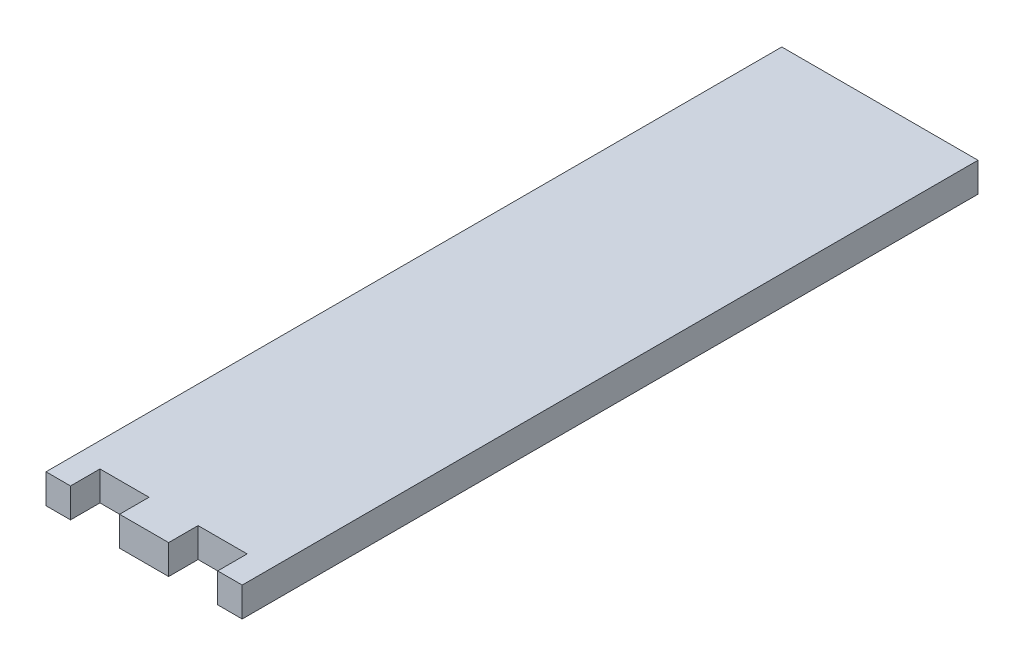
ISO-10303-21;
HEADER;
FILE_DESCRIPTION(('STEP AP214'),'2;1');
FILE_NAME('part.step','',(''),(''),'','','');
FILE_SCHEMA(('AUTOMOTIVE_DESIGN { 1 0 10303 214 1 1 1 1 }'));
ENDSEC;
DATA;
#1=APPLICATION_CONTEXT('core data for automotive mechanical design processes');
#2=APPLICATION_PROTOCOL_DEFINITION('international standard','automotive_design',2000,#1);
#3=PRODUCT_CONTEXT('',#1,'mechanical');
#4=PRODUCT('Part','Part','',(#3));
#5=PRODUCT_RELATED_PRODUCT_CATEGORY('part','',(#4));
#6=PRODUCT_DEFINITION_FORMATION('','',#4);
#7=PRODUCT_DEFINITION_CONTEXT('part definition',#1,'design');
#8=PRODUCT_DEFINITION('design','',#6,#7);
#9=PRODUCT_DEFINITION_SHAPE('','',#8);
#10=(LENGTH_UNIT() NAMED_UNIT(*) SI_UNIT(.MILLI.,.METRE.));
#11=(NAMED_UNIT(*) PLANE_ANGLE_UNIT() SI_UNIT($,.RADIAN.));
#12=(NAMED_UNIT(*) SI_UNIT($,.STERADIAN.) SOLID_ANGLE_UNIT());
#13=UNCERTAINTY_MEASURE_WITH_UNIT(LENGTH_MEASURE(1.E-05),#10,'distance_accuracy_value','');
#14=(GEOMETRIC_REPRESENTATION_CONTEXT(3) GLOBAL_UNCERTAINTY_ASSIGNED_CONTEXT((#13)) GLOBAL_UNIT_ASSIGNED_CONTEXT((#10,
#11,#12)) REPRESENTATION_CONTEXT('',''));
#15=CARTESIAN_POINT('',(0.,0.,0.));
#16=DIRECTION('',(0.,0.,1.));
#17=DIRECTION('',(1.,0.,0.));
#18=AXIS2_PLACEMENT_3D('',#15,#16,#17);
#19=CARTESIAN_POINT('',(-9.99999999999998,3.,37.4999999999999));
#20=DIRECTION('',(0.,0.,-1.));
#21=DIRECTION('',(-1.,0.,0.));
#22=AXIS2_PLACEMENT_3D('',#19,#20,#21);
#23=PLANE('',#22);
#24=DIRECTION('',(0.,-1.,0.));
#25=VECTOR('',#24,1.);
#26=CARTESIAN_POINT('',(2.49999999999998,3.,37.4999999999999));
#27=LINE('',#26,#25);
#28=CARTESIAN_POINT('',(2.49999999999998,3.,37.4999999999999));
#29=VERTEX_POINT('',#28);
#30=CARTESIAN_POINT('',(2.49999999999998,0.,37.4999999999999));
#31=VERTEX_POINT('',#30);
#32=EDGE_CURVE('E144',#29,#31,#27,.T.);
#33=ORIENTED_EDGE('',*,*,#32,.F.);
#34=DIRECTION('',(1.,0.,0.));
#35=VECTOR('',#34,1.);
#36=CARTESIAN_POINT('',(-9.99999999999998,3.,37.4999999999999));
#37=LINE('',#36,#35);
#38=CARTESIAN_POINT('',(-2.49999999999998,3.,37.4999999999999));
#39=VERTEX_POINT('',#38);
#40=EDGE_CURVE('E140',#39,#29,#37,.T.);
#41=ORIENTED_EDGE('',*,*,#40,.F.);
#42=DIRECTION('',(0.,-1.,0.));
#43=VECTOR('',#42,1.);
#44=CARTESIAN_POINT('',(-2.49999999999998,3.,37.4999999999999));
#45=LINE('',#44,#43);
#46=CARTESIAN_POINT('',(-2.49999999999998,0.,37.4999999999999));
#47=VERTEX_POINT('',#46);
#48=EDGE_CURVE('E158',#39,#47,#45,.T.);
#49=ORIENTED_EDGE('',*,*,#48,.T.);
#50=DIRECTION('',(1.,0.,0.));
#51=VECTOR('',#50,1.);
#52=CARTESIAN_POINT('',(-9.99999999999998,0.,37.4999999999999));
#53=LINE('',#52,#51);
#54=EDGE_CURVE('E191',#47,#31,#53,.T.);
#55=ORIENTED_EDGE('',*,*,#54,.T.);
#56=EDGE_LOOP('',(#33,#41,#49,#55));
#57=FACE_BOUND('',#56,.T.);
#58=ADVANCED_FACE('F33',(#57),#23,.F.);
#59=DIRECTION('',(0.,-1.,0.));
#60=VECTOR('',#59,1.);
#61=CARTESIAN_POINT('',(7.49999999999998,3.,37.4999999999999));
#62=LINE('',#61,#60);
#63=CARTESIAN_POINT('',(7.49999999999998,3.,37.4999999999999));
#64=VERTEX_POINT('',#63);
#65=CARTESIAN_POINT('',(7.49999999999998,0.,37.4999999999999));
#66=VERTEX_POINT('',#65);
#67=EDGE_CURVE('E147',#64,#66,#62,.T.);
#68=ORIENTED_EDGE('',*,*,#67,.T.);
#69=CARTESIAN_POINT('',(10.,0.,37.4999999999999));
#70=VERTEX_POINT('',#69);
#71=EDGE_CURVE('E188',#66,#70,#53,.T.);
#72=ORIENTED_EDGE('',*,*,#71,.T.);
#73=DIRECTION('',(0.,-1.,0.));
#74=VECTOR('',#73,1.);
#75=CARTESIAN_POINT('',(10.,3.,37.4999999999999));
#76=LINE('',#75,#74);
#77=CARTESIAN_POINT('',(10.,3.,37.4999999999999));
#78=VERTEX_POINT('',#77);
#79=EDGE_CURVE('E181',#78,#70,#76,.T.);
#80=ORIENTED_EDGE('',*,*,#79,.F.);
#81=EDGE_CURVE('E177',#64,#78,#37,.T.);
#82=ORIENTED_EDGE('',*,*,#81,.F.);
#83=EDGE_LOOP('',(#68,#72,#80,#82));
#84=FACE_BOUND('',#83,.T.);
#85=ADVANCED_FACE('F219',(#84),#23,.F.);
#86=CARTESIAN_POINT('',(0.,3.,0.));
#87=DIRECTION('',(0.,-1.,0.));
#88=DIRECTION('',(0.,0.,-1.));
#89=AXIS2_PLACEMENT_3D('',#86,#87,#88);
#90=PLANE('',#89);
#91=DIRECTION('',(0.,0.,1.));
#92=VECTOR('',#91,1.);
#93=CARTESIAN_POINT('',(2.49999999999998,3.,34.4999999999999));
#94=LINE('',#93,#92);
#95=CARTESIAN_POINT('',(2.49999999999998,3.,34.4999999999999));
#96=VERTEX_POINT('',#95);
#97=EDGE_CURVE('E129',#96,#29,#94,.T.);
#98=ORIENTED_EDGE('',*,*,#97,.F.);
#99=DIRECTION('',(-1.,0.,0.));
#100=VECTOR('',#99,1.);
#101=CARTESIAN_POINT('',(2.49999999999998,3.,34.4999999999999));
#102=LINE('',#101,#100);
#103=CARTESIAN_POINT('',(7.49999999999998,3.,34.4999999999999));
#104=VERTEX_POINT('',#103);
#105=EDGE_CURVE('E121',#104,#96,#102,.T.);
#106=ORIENTED_EDGE('',*,*,#105,.F.);
#107=DIRECTION('',(0.,0.,-1.));
#108=VECTOR('',#107,1.);
#109=CARTESIAN_POINT('',(7.49999999999998,3.,34.4999999999999));
#110=LINE('',#109,#108);
#111=EDGE_CURVE('E128',#64,#104,#110,.T.);
#112=ORIENTED_EDGE('',*,*,#111,.F.);
#113=ORIENTED_EDGE('',*,*,#81,.T.);
#114=DIRECTION('',(0.,0.,-1.));
#115=VECTOR('',#114,1.);
#116=CARTESIAN_POINT('',(10.,3.,37.4999999999999));
#117=LINE('',#116,#115);
#118=CARTESIAN_POINT('',(10.,3.,-37.5000000000001));
#119=VERTEX_POINT('',#118);
#120=EDGE_CURVE('E169',#78,#119,#117,.T.);
#121=ORIENTED_EDGE('',*,*,#120,.T.);
#122=DIRECTION('',(-1.,0.,0.));
#123=VECTOR('',#122,1.);
#124=CARTESIAN_POINT('',(-9.99999999999998,3.,-37.5000000000001));
#125=LINE('',#124,#123);
#126=CARTESIAN_POINT('',(-9.99999999999998,3.,-37.5000000000001));
#127=VERTEX_POINT('',#126);
#128=EDGE_CURVE('E172',#119,#127,#125,.T.);
#129=ORIENTED_EDGE('',*,*,#128,.T.);
#130=DIRECTION('',(0.,0.,1.));
#131=VECTOR('',#130,1.);
#132=CARTESIAN_POINT('',(-9.99999999999998,3.,37.4999999999999));
#133=LINE('',#132,#131);
#134=CARTESIAN_POINT('',(-9.99999999999998,3.,37.4999999999999));
#135=VERTEX_POINT('',#134);
#136=EDGE_CURVE('E175',#127,#135,#133,.T.);
#137=ORIENTED_EDGE('',*,*,#136,.T.);
#138=CARTESIAN_POINT('',(-7.49999999999998,3.,37.4999999999999));
#139=VERTEX_POINT('',#138);
#140=EDGE_CURVE('E178',#135,#139,#37,.T.);
#141=ORIENTED_EDGE('',*,*,#140,.T.);
#142=DIRECTION('',(0.,0.,-1.));
#143=VECTOR('',#142,1.);
#144=CARTESIAN_POINT('',(-7.49999999999998,3.,34.4999999999999));
#145=LINE('',#144,#143);
#146=CARTESIAN_POINT('',(-7.49999999999998,3.,34.4999999999999));
#147=VERTEX_POINT('',#146);
#148=EDGE_CURVE('E152',#139,#147,#145,.T.);
#149=ORIENTED_EDGE('',*,*,#148,.T.);
#150=DIRECTION('',(1.,0.,0.));
#151=VECTOR('',#150,1.);
#152=CARTESIAN_POINT('',(-2.49999999999998,3.,34.4999999999999));
#153=LINE('',#152,#151);
#154=CARTESIAN_POINT('',(-2.49999999999998,3.,34.4999999999999));
#155=VERTEX_POINT('',#154);
#156=EDGE_CURVE('E155',#147,#155,#153,.T.);
#157=ORIENTED_EDGE('',*,*,#156,.T.);
#158=DIRECTION('',(0.,0.,1.));
#159=VECTOR('',#158,1.);
#160=CARTESIAN_POINT('',(-2.49999999999998,3.,34.4999999999999));
#161=LINE('',#160,#159);
#162=EDGE_CURVE('E146',#155,#39,#161,.T.);
#163=ORIENTED_EDGE('',*,*,#162,.T.);
#164=ORIENTED_EDGE('',*,*,#40,.T.);
#165=EDGE_LOOP('',(#98,#106,#112,#113,#121,#129,#137,#141,#149,#157,#163,#164));
#166=FACE_BOUND('',#165,.T.);
#167=ADVANCED_FACE('F137',(#166),#90,.F.);
#168=CARTESIAN_POINT('',(0.,0.,0.));
#169=DIRECTION('',(0.,-1.,0.));
#170=DIRECTION('',(0.,0.,-1.));
#171=AXIS2_PLACEMENT_3D('',#168,#169,#170);
#172=PLANE('',#171);
#173=DIRECTION('',(-1.,0.,0.));
#174=VECTOR('',#173,1.);
#175=CARTESIAN_POINT('',(0.,0.,34.4999999999999));
#176=LINE('',#175,#174);
#177=CARTESIAN_POINT('',(7.49999999999998,0.,34.4999999999999));
#178=VERTEX_POINT('',#177);
#179=CARTESIAN_POINT('',(2.49999999999998,0.,34.4999999999999));
#180=VERTEX_POINT('',#179);
#181=EDGE_CURVE('E209',#178,#180,#176,.T.);
#182=ORIENTED_EDGE('',*,*,#181,.T.);
#183=DIRECTION('',(0.,0.,1.));
#184=VECTOR('',#183,1.);
#185=CARTESIAN_POINT('',(2.49999999999998,0.,0.));
#186=LINE('',#185,#184);
#187=EDGE_CURVE('E11',#180,#31,#186,.T.);
#188=ORIENTED_EDGE('',*,*,#187,.T.);
#189=ORIENTED_EDGE('',*,*,#54,.F.);
#190=DIRECTION('',(0.,0.,1.));
#191=VECTOR('',#190,1.);
#192=CARTESIAN_POINT('',(-2.49999999999998,0.,0.));
#193=LINE('',#192,#191);
#194=CARTESIAN_POINT('',(-2.49999999999998,0.,34.4999999999999));
#195=VERTEX_POINT('',#194);
#196=EDGE_CURVE('E207',#195,#47,#193,.T.);
#197=ORIENTED_EDGE('',*,*,#196,.F.);
#198=DIRECTION('',(1.,0.,0.));
#199=VECTOR('',#198,1.);
#200=CARTESIAN_POINT('',(0.,0.,34.4999999999999));
#201=LINE('',#200,#199);
#202=CARTESIAN_POINT('',(-7.49999999999998,0.,34.4999999999999));
#203=VERTEX_POINT('',#202);
#204=EDGE_CURVE('E205',#203,#195,#201,.T.);
#205=ORIENTED_EDGE('',*,*,#204,.F.);
#206=DIRECTION('',(0.,0.,-1.));
#207=VECTOR('',#206,1.);
#208=CARTESIAN_POINT('',(-7.49999999999998,0.,0.));
#209=LINE('',#208,#207);
#210=CARTESIAN_POINT('',(-7.49999999999998,0.,37.4999999999999));
#211=VERTEX_POINT('',#210);
#212=EDGE_CURVE('E203',#211,#203,#209,.T.);
#213=ORIENTED_EDGE('',*,*,#212,.F.);
#214=CARTESIAN_POINT('',(-9.99999999999998,0.,37.4999999999999));
#215=VERTEX_POINT('',#214);
#216=EDGE_CURVE('E173',#215,#211,#53,.T.);
#217=ORIENTED_EDGE('',*,*,#216,.F.);
#218=DIRECTION('',(0.,0.,1.));
#219=VECTOR('',#218,1.);
#220=CARTESIAN_POINT('',(-9.99999999999998,0.,37.4999999999999));
#221=LINE('',#220,#219);
#222=CARTESIAN_POINT('',(-9.99999999999998,0.,-37.5000000000001));
#223=VERTEX_POINT('',#222);
#224=EDGE_CURVE('E186',#223,#215,#221,.T.);
#225=ORIENTED_EDGE('',*,*,#224,.F.);
#226=DIRECTION('',(-1.,0.,0.));
#227=VECTOR('',#226,1.);
#228=CARTESIAN_POINT('',(-9.99999999999998,0.,-37.5000000000001));
#229=LINE('',#228,#227);
#230=CARTESIAN_POINT('',(10.,0.,-37.5000000000001));
#231=VERTEX_POINT('',#230);
#232=EDGE_CURVE('E184',#231,#223,#229,.T.);
#233=ORIENTED_EDGE('',*,*,#232,.F.);
#234=DIRECTION('',(0.,0.,-1.));
#235=VECTOR('',#234,1.);
#236=CARTESIAN_POINT('',(10.,0.,37.4999999999999));
#237=LINE('',#236,#235);
#238=EDGE_CURVE('E162',#70,#231,#237,.T.);
#239=ORIENTED_EDGE('',*,*,#238,.F.);
#240=ORIENTED_EDGE('',*,*,#71,.F.);
#241=DIRECTION('',(0.,0.,-1.));
#242=VECTOR('',#241,1.);
#243=CARTESIAN_POINT('',(7.49999999999998,0.,0.));
#244=LINE('',#243,#242);
#245=EDGE_CURVE('E41',#66,#178,#244,.T.);
#246=ORIENTED_EDGE('',*,*,#245,.T.);
#247=EDGE_LOOP('',(#182,#188,#189,#197,#205,#213,#217,#225,#233,#239,#240,#246));
#248=FACE_BOUND('',#247,.T.);
#249=ADVANCED_FACE('F213',(#248),#172,.T.);
#250=CARTESIAN_POINT('',(10.,3.,37.4999999999999));
#251=DIRECTION('',(-1.,0.,0.));
#252=DIRECTION('',(0.,0.,1.));
#253=AXIS2_PLACEMENT_3D('',#250,#251,#252);
#254=PLANE('',#253);
#255=ORIENTED_EDGE('',*,*,#238,.T.);
#256=DIRECTION('',(0.,-1.,0.));
#257=VECTOR('',#256,1.);
#258=CARTESIAN_POINT('',(10.,3.,-37.5000000000001));
#259=LINE('',#258,#257);
#260=EDGE_CURVE('E200',#119,#231,#259,.T.);
#261=ORIENTED_EDGE('',*,*,#260,.F.);
#262=ORIENTED_EDGE('',*,*,#120,.F.);
#263=ORIENTED_EDGE('',*,*,#79,.T.);
#264=EDGE_LOOP('',(#255,#261,#262,#263));
#265=FACE_BOUND('',#264,.T.);
#266=ADVANCED_FACE('F35',(#265),#254,.F.);
#267=CARTESIAN_POINT('',(-9.99999999999998,3.,-37.5000000000001));
#268=DIRECTION('',(0.,0.,1.));
#269=DIRECTION('',(1.,0.,0.));
#270=AXIS2_PLACEMENT_3D('',#267,#268,#269);
#271=PLANE('',#270);
#272=ORIENTED_EDGE('',*,*,#232,.T.);
#273=DIRECTION('',(0.,-1.,0.));
#274=VECTOR('',#273,1.);
#275=CARTESIAN_POINT('',(-9.99999999999998,3.,-37.5000000000001));
#276=LINE('',#275,#274);
#277=EDGE_CURVE('E197',#127,#223,#276,.T.);
#278=ORIENTED_EDGE('',*,*,#277,.F.);
#279=ORIENTED_EDGE('',*,*,#128,.F.);
#280=ORIENTED_EDGE('',*,*,#260,.T.);
#281=EDGE_LOOP('',(#272,#278,#279,#280));
#282=FACE_BOUND('',#281,.T.);
#283=ADVANCED_FACE('F226',(#282),#271,.F.);
#284=CARTESIAN_POINT('',(-9.99999999999998,3.,37.4999999999999));
#285=DIRECTION('',(1.,0.,0.));
#286=DIRECTION('',(0.,0.,-1.));
#287=AXIS2_PLACEMENT_3D('',#284,#285,#286);
#288=PLANE('',#287);
#289=ORIENTED_EDGE('',*,*,#224,.T.);
#290=DIRECTION('',(0.,-1.,0.));
#291=VECTOR('',#290,1.);
#292=CARTESIAN_POINT('',(-9.99999999999998,3.,37.4999999999999));
#293=LINE('',#292,#291);
#294=EDGE_CURVE('E194',#135,#215,#293,.T.);
#295=ORIENTED_EDGE('',*,*,#294,.F.);
#296=ORIENTED_EDGE('',*,*,#136,.F.);
#297=ORIENTED_EDGE('',*,*,#277,.T.);
#298=EDGE_LOOP('',(#289,#295,#296,#297));
#299=FACE_BOUND('',#298,.T.);
#300=ADVANCED_FACE('F231',(#299),#288,.F.);
#301=ORIENTED_EDGE('',*,*,#216,.T.);
#302=DIRECTION('',(0.,-1.,0.));
#303=VECTOR('',#302,1.);
#304=CARTESIAN_POINT('',(-7.49999999999998,3.,37.4999999999999));
#305=LINE('',#304,#303);
#306=EDGE_CURVE('E56',#139,#211,#305,.T.);
#307=ORIENTED_EDGE('',*,*,#306,.F.);
#308=ORIENTED_EDGE('',*,*,#140,.F.);
#309=ORIENTED_EDGE('',*,*,#294,.T.);
#310=EDGE_LOOP('',(#301,#307,#308,#309));
#311=FACE_BOUND('',#310,.T.);
#312=ADVANCED_FACE('F234',(#311),#23,.F.);
#313=CARTESIAN_POINT('',(-2.49999999999998,3.,34.4999999999999));
#314=DIRECTION('',(1.,0.,0.));
#315=DIRECTION('',(0.,0.,-1.));
#316=AXIS2_PLACEMENT_3D('',#313,#314,#315);
#317=PLANE('',#316);
#318=ORIENTED_EDGE('',*,*,#196,.T.);
#319=ORIENTED_EDGE('',*,*,#48,.F.);
#320=ORIENTED_EDGE('',*,*,#162,.F.);
#321=DIRECTION('',(0.,-1.,0.));
#322=VECTOR('',#321,1.);
#323=CARTESIAN_POINT('',(-2.49999999999998,3.,34.4999999999999));
#324=LINE('',#323,#322);
#325=EDGE_CURVE('E159',#155,#195,#324,.T.);
#326=ORIENTED_EDGE('',*,*,#325,.T.);
#327=EDGE_LOOP('',(#318,#319,#320,#326));
#328=FACE_BOUND('',#327,.T.);
#329=ADVANCED_FACE('F247',(#328),#317,.F.);
#330=CARTESIAN_POINT('',(-2.49999999999998,3.,34.4999999999999));
#331=DIRECTION('',(0.,0.,-1.));
#332=DIRECTION('',(-1.,0.,0.));
#333=AXIS2_PLACEMENT_3D('',#330,#331,#332);
#334=PLANE('',#333);
#335=ORIENTED_EDGE('',*,*,#204,.T.);
#336=ORIENTED_EDGE('',*,*,#325,.F.);
#337=ORIENTED_EDGE('',*,*,#156,.F.);
#338=DIRECTION('',(0.,-1.,0.));
#339=VECTOR('',#338,1.);
#340=CARTESIAN_POINT('',(-7.49999999999998,3.,34.4999999999999));
#341=LINE('',#340,#339);
#342=EDGE_CURVE('E163',#147,#203,#341,.T.);
#343=ORIENTED_EDGE('',*,*,#342,.T.);
#344=EDGE_LOOP('',(#335,#336,#337,#343));
#345=FACE_BOUND('',#344,.T.);
#346=ADVANCED_FACE('F241',(#345),#334,.F.);
#347=CARTESIAN_POINT('',(-7.49999999999998,3.,34.4999999999999));
#348=DIRECTION('',(-1.,0.,0.));
#349=DIRECTION('',(0.,0.,1.));
#350=AXIS2_PLACEMENT_3D('',#347,#348,#349);
#351=PLANE('',#350);
#352=ORIENTED_EDGE('',*,*,#212,.T.);
#353=ORIENTED_EDGE('',*,*,#342,.F.);
#354=ORIENTED_EDGE('',*,*,#148,.F.);
#355=ORIENTED_EDGE('',*,*,#306,.T.);
#356=EDGE_LOOP('',(#352,#353,#354,#355));
#357=FACE_BOUND('',#356,.T.);
#358=ADVANCED_FACE('F238',(#357),#351,.F.);
#359=CARTESIAN_POINT('',(2.49999999999998,3.,34.4999999999999));
#360=DIRECTION('',(1.,0.,0.));
#361=DIRECTION('',(0.,0.,-1.));
#362=AXIS2_PLACEMENT_3D('',#359,#360,#361);
#363=PLANE('',#362);
#364=DIRECTION('',(0.,-1.,0.));
#365=VECTOR('',#364,1.);
#366=CARTESIAN_POINT('',(2.49999999999998,3.,34.4999999999999));
#367=LINE('',#366,#365);
#368=EDGE_CURVE('E48',#96,#180,#367,.T.);
#369=ORIENTED_EDGE('',*,*,#368,.F.);
#370=ORIENTED_EDGE('',*,*,#97,.T.);
#371=ORIENTED_EDGE('',*,*,#32,.T.);
#372=ORIENTED_EDGE('',*,*,#187,.F.);
#373=EDGE_LOOP('',(#369,#370,#371,#372));
#374=FACE_BOUND('',#373,.T.);
#375=ADVANCED_FACE('F132',(#374),#363,.T.);
#376=CARTESIAN_POINT('',(7.49999999999998,3.,34.4999999999999));
#377=DIRECTION('',(-1.,0.,0.));
#378=DIRECTION('',(0.,0.,1.));
#379=AXIS2_PLACEMENT_3D('',#376,#377,#378);
#380=PLANE('',#379);
#381=ORIENTED_EDGE('',*,*,#67,.F.);
#382=ORIENTED_EDGE('',*,*,#111,.T.);
#383=DIRECTION('',(0.,-1.,0.));
#384=VECTOR('',#383,1.);
#385=CARTESIAN_POINT('',(7.49999999999998,3.,34.4999999999999));
#386=LINE('',#385,#384);
#387=EDGE_CURVE('E124',#104,#178,#386,.T.);
#388=ORIENTED_EDGE('',*,*,#387,.T.);
#389=ORIENTED_EDGE('',*,*,#245,.F.);
#390=EDGE_LOOP('',(#381,#382,#388,#389));
#391=FACE_BOUND('',#390,.T.);
#392=ADVANCED_FACE('F216',(#391),#380,.T.);
#393=CARTESIAN_POINT('',(2.49999999999998,3.,34.4999999999999));
#394=DIRECTION('',(0.,0.,1.));
#395=DIRECTION('',(1.,0.,0.));
#396=AXIS2_PLACEMENT_3D('',#393,#394,#395);
#397=PLANE('',#396);
#398=ORIENTED_EDGE('',*,*,#387,.F.);
#399=ORIENTED_EDGE('',*,*,#105,.T.);
#400=ORIENTED_EDGE('',*,*,#368,.T.);
#401=ORIENTED_EDGE('',*,*,#181,.F.);
#402=EDGE_LOOP('',(#398,#399,#400,#401));
#403=FACE_BOUND('',#402,.T.);
#404=ADVANCED_FACE('F122',(#403),#397,.T.);
#405=CLOSED_SHELL('',(#58,#85,#167,#249,#266,#283,#300,#312,#329,#346,#358,#375,#392,#404));
#406=MANIFOLD_SOLID_BREP('B2',#405);
#407=ADVANCED_BREP_SHAPE_REPRESENTATION('',(#18,#406),#14);
#408=SHAPE_DEFINITION_REPRESENTATION(#9,#407);
ENDSEC;
END-ISO-10303-21;
